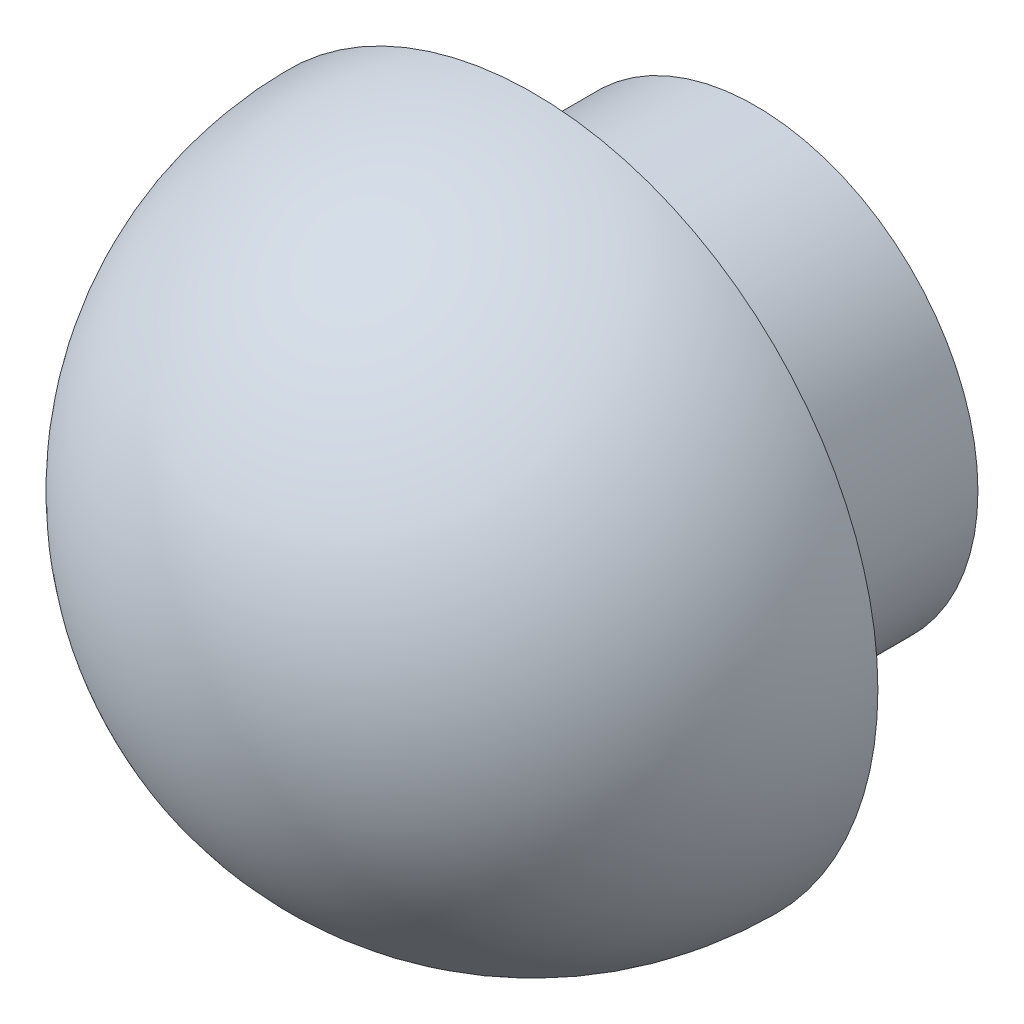
ISO-10303-21;
HEADER;
FILE_DESCRIPTION(('STEP AP214'),'2;1');
FILE_NAME('part.step','',(''),(''),'','','');
FILE_SCHEMA(('AUTOMOTIVE_DESIGN { 1 0 10303 214 1 1 1 1 }'));
ENDSEC;
DATA;
#1=APPLICATION_CONTEXT('core data for automotive mechanical design processes');
#2=APPLICATION_PROTOCOL_DEFINITION('international standard','automotive_design',2000,#1);
#3=PRODUCT_CONTEXT('',#1,'mechanical');
#4=PRODUCT('Part','Part','',(#3));
#5=PRODUCT_RELATED_PRODUCT_CATEGORY('part','',(#4));
#6=PRODUCT_DEFINITION_FORMATION('','',#4);
#7=PRODUCT_DEFINITION_CONTEXT('part definition',#1,'design');
#8=PRODUCT_DEFINITION('design','',#6,#7);
#9=PRODUCT_DEFINITION_SHAPE('','',#8);
#10=(LENGTH_UNIT() NAMED_UNIT(*) SI_UNIT(.MILLI.,.METRE.));
#11=(NAMED_UNIT(*) PLANE_ANGLE_UNIT() SI_UNIT($,.RADIAN.));
#12=(NAMED_UNIT(*) SI_UNIT($,.STERADIAN.) SOLID_ANGLE_UNIT());
#13=UNCERTAINTY_MEASURE_WITH_UNIT(LENGTH_MEASURE(1.E-05),#10,'distance_accuracy_value','');
#14=(GEOMETRIC_REPRESENTATION_CONTEXT(3) GLOBAL_UNCERTAINTY_ASSIGNED_CONTEXT((#13)) GLOBAL_UNIT_ASSIGNED_CONTEXT((#10,
#11,#12)) REPRESENTATION_CONTEXT('',''));
#15=CARTESIAN_POINT('',(0.,0.,0.));
#16=DIRECTION('',(0.,0.,1.));
#17=DIRECTION('',(1.,0.,0.));
#18=AXIS2_PLACEMENT_3D('',#15,#16,#17);
#19=CARTESIAN_POINT('',(0.,0.,15.));
#20=DIRECTION('',(0.,0.,-1.));
#21=DIRECTION('',(-1.,0.,0.));
#22=AXIS2_PLACEMENT_3D('',#19,#20,#21);
#23=CYLINDRICAL_SURFACE('',#22,15.);
#24=CARTESIAN_POINT('',(0.,0.,15.));
#25=DIRECTION('',(0.,0.,1.));
#26=DIRECTION('',(1.,0.,0.));
#27=AXIS2_PLACEMENT_3D('',#24,#25,#26);
#28=CIRCLE('',#27,15.);
#29=CARTESIAN_POINT('',(15.,0.,15.));
#30=VERTEX_POINT('',#29);
#31=EDGE_CURVE('E10',#30,#30,#28,.T.);
#32=ORIENTED_EDGE('',*,*,#31,.F.);
#33=EDGE_LOOP('',(#32));
#34=FACE_BOUND('',#33,.T.);
#35=CARTESIAN_POINT('',(0.,0.,0.));
#36=DIRECTION('',(0.,0.,1.));
#37=DIRECTION('',(1.,0.,0.));
#38=AXIS2_PLACEMENT_3D('',#35,#36,#37);
#39=CIRCLE('',#38,15.);
#40=CARTESIAN_POINT('',(15.,0.,0.));
#41=VERTEX_POINT('',#40);
#42=EDGE_CURVE('E40',#41,#41,#39,.T.);
#43=ORIENTED_EDGE('',*,*,#42,.T.);
#44=EDGE_LOOP('',(#43));
#45=FACE_BOUND('',#44,.T.);
#46=ADVANCED_FACE('F37',(#34,#45),#23,.T.);
#47=CARTESIAN_POINT('',(0.,0.,0.));
#48=DIRECTION('',(0.,0.,1.));
#49=DIRECTION('',(1.,0.,0.));
#50=AXIS2_PLACEMENT_3D('',#47,#48,#49);
#51=PLANE('',#50);
#52=ORIENTED_EDGE('',*,*,#42,.F.);
#53=EDGE_LOOP('',(#52));
#54=FACE_BOUND('',#53,.T.);
#55=ADVANCED_FACE('F63',(#54),#51,.F.);
#56=CARTESIAN_POINT('',(0.,0.,15.));
#57=DIRECTION('',(0.,1.,0.));
#58=DIRECTION('',(-1.,0.,0.));
#59=AXIS2_PLACEMENT_3D('',#56,#57,#58);
#60=SPHERICAL_SURFACE('',#59,23.25);
#61=CARTESIAN_POINT('',(0.,0.,15.));
#62=DIRECTION('',(0.,0.,1.));
#63=DIRECTION('',(1.,0.,0.));
#64=AXIS2_PLACEMENT_3D('',#61,#62,#63);
#65=SPHERICAL_SURFACE('',#64,23.25);
#66=CARTESIAN_POINT('',(0.,0.,15.));
#67=DIRECTION('',(0.,0.,1.));
#68=DIRECTION('',(1.,0.,0.));
#69=AXIS2_PLACEMENT_3D('',#66,#67,#68);
#70=CIRCLE('',#69,23.25);
#71=CARTESIAN_POINT('',(23.25,0.,15.0000000000002));
#72=VERTEX_POINT('',#71);
#73=EDGE_CURVE('E49',#72,#72,#70,.T.);
#74=ORIENTED_EDGE('',*,*,#73,.T.);
#75=EDGE_LOOP('',(#74));
#76=FACE_BOUND('',#75,.T.);
#77=ADVANCED_FACE('F55',(#76),#65,.T.);
#78=CARTESIAN_POINT('',(0.,0.,15.));
#79=DIRECTION('',(0.,0.,1.));
#80=DIRECTION('',(1.,0.,0.));
#81=AXIS2_PLACEMENT_3D('',#78,#79,#80);
#82=PLANE('',#81);
#83=ORIENTED_EDGE('',*,*,#31,.T.);
#84=EDGE_LOOP('',(#83));
#85=FACE_BOUND('',#84,.T.);
#86=ORIENTED_EDGE('',*,*,#73,.F.);
#87=EDGE_LOOP('',(#86));
#88=FACE_BOUND('',#87,.T.);
#89=ADVANCED_FACE('F57',(#85,#88),#82,.F.);
#90=CLOSED_SHELL('',(#46,#55,#77,#89));
#91=MANIFOLD_SOLID_BREP('B2',#90);
#92=ADVANCED_BREP_SHAPE_REPRESENTATION('',(#18,#91),#14);
#93=SHAPE_DEFINITION_REPRESENTATION(#9,#92);
ENDSEC;
END-ISO-10303-21;
